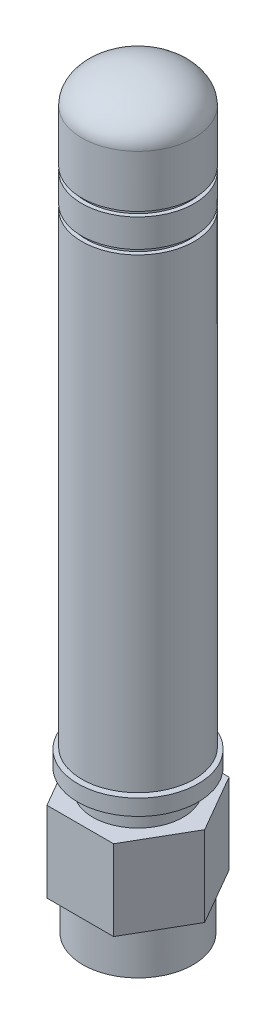
ISO-10303-21;
HEADER;
FILE_DESCRIPTION(('STEP AP214'),'2;1');
FILE_NAME('part.step','',(''),(''),'','','');
FILE_SCHEMA(('AUTOMOTIVE_DESIGN { 1 0 10303 214 1 1 1 1 }'));
ENDSEC;
DATA;
#1=APPLICATION_CONTEXT('core data for automotive mechanical design processes');
#2=APPLICATION_PROTOCOL_DEFINITION('international standard','automotive_design',2000,#1);
#3=PRODUCT_CONTEXT('',#1,'mechanical');
#4=PRODUCT('Part','Part','',(#3));
#5=PRODUCT_RELATED_PRODUCT_CATEGORY('part','',(#4));
#6=PRODUCT_DEFINITION_FORMATION('','',#4);
#7=PRODUCT_DEFINITION_CONTEXT('part definition',#1,'design');
#8=PRODUCT_DEFINITION('design','',#6,#7);
#9=PRODUCT_DEFINITION_SHAPE('','',#8);
#10=(LENGTH_UNIT() NAMED_UNIT(*) SI_UNIT(.MILLI.,.METRE.));
#11=(NAMED_UNIT(*) PLANE_ANGLE_UNIT() SI_UNIT($,.RADIAN.));
#12=(NAMED_UNIT(*) SI_UNIT($,.STERADIAN.) SOLID_ANGLE_UNIT());
#13=UNCERTAINTY_MEASURE_WITH_UNIT(LENGTH_MEASURE(1.E-05),#10,'distance_accuracy_value','');
#14=(GEOMETRIC_REPRESENTATION_CONTEXT(3) GLOBAL_UNCERTAINTY_ASSIGNED_CONTEXT((#13)) GLOBAL_UNIT_ASSIGNED_CONTEXT((#10,
#11,#12)) REPRESENTATION_CONTEXT('',''));
#15=CARTESIAN_POINT('',(0.,0.,0.));
#16=DIRECTION('',(0.,0.,1.));
#17=DIRECTION('',(1.,0.,0.));
#18=AXIS2_PLACEMENT_3D('',#15,#16,#17);
#19=CARTESIAN_POINT('',(2.2225,2.667,0.));
#20=DIRECTION('',(0.,-1.,0.));
#21=DIRECTION('',(0.,0.,-1.));
#22=AXIS2_PLACEMENT_3D('',#19,#20,#21);
#23=PLANE('',#22);
#24=CARTESIAN_POINT('',(0.,2.667,0.));
#25=DIRECTION('',(0.,-1.,0.));
#26=DIRECTION('',(0.,0.,-1.));
#27=AXIS2_PLACEMENT_3D('',#24,#25,#26);
#28=CIRCLE('',#27,3.90525);
#29=CARTESIAN_POINT('',(0.,2.667,-3.90525));
#30=VERTEX_POINT('',#29);
#31=EDGE_CURVE('E12',#30,#30,#28,.T.);
#32=ORIENTED_EDGE('',*,*,#31,.T.);
#33=EDGE_LOOP('',(#32));
#34=FACE_BOUND('',#33,.T.);
#35=CARTESIAN_POINT('',(0.,2.667,0.));
#36=DIRECTION('',(0.,-1.,0.));
#37=DIRECTION('',(0.,0.,-1.));
#38=AXIS2_PLACEMENT_3D('',#35,#36,#37);
#39=CIRCLE('',#38,2.2225);
#40=CARTESIAN_POINT('',(0.,2.667,-2.2225));
#41=VERTEX_POINT('',#40);
#42=EDGE_CURVE('E118',#41,#41,#39,.T.);
#43=ORIENTED_EDGE('',*,*,#42,.F.);
#44=EDGE_LOOP('',(#43));
#45=FACE_BOUND('',#44,.T.);
#46=ADVANCED_FACE('F46',(#34,#45),#23,.T.);
#47=CARTESIAN_POINT('',(0.,0.,0.));
#48=DIRECTION('',(0.,-1.,0.));
#49=DIRECTION('',(0.,0.,-1.));
#50=AXIS2_PLACEMENT_3D('',#47,#48,#49);
#51=CYLINDRICAL_SURFACE('',#50,3.90525);
#52=CARTESIAN_POINT('',(0.,35.0393,0.));
#53=DIRECTION('',(0.,-1.,0.));
#54=DIRECTION('',(0.,0.,-1.));
#55=AXIS2_PLACEMENT_3D('',#52,#53,#54);
#56=CIRCLE('',#55,3.90525);
#57=CARTESIAN_POINT('',(0.,35.0393,-3.90525));
#58=VERTEX_POINT('',#57);
#59=EDGE_CURVE('E52',#58,#58,#56,.T.);
#60=ORIENTED_EDGE('',*,*,#59,.T.);
#61=EDGE_LOOP('',(#60));
#62=FACE_BOUND('',#61,.T.);
#63=ORIENTED_EDGE('',*,*,#31,.F.);
#64=EDGE_LOOP('',(#63));
#65=FACE_BOUND('',#64,.T.);
#66=ADVANCED_FACE('F95',(#62,#65),#51,.T.);
#67=CARTESIAN_POINT('',(3.90525,35.0393,0.));
#68=DIRECTION('',(0.,1.,0.));
#69=DIRECTION('',(0.,0.,1.));
#70=AXIS2_PLACEMENT_3D('',#67,#68,#69);
#71=PLANE('',#70);
#72=CARTESIAN_POINT('',(0.,35.0393,0.));
#73=DIRECTION('',(0.,-1.,0.));
#74=DIRECTION('',(0.,0.,-1.));
#75=AXIS2_PLACEMENT_3D('',#72,#73,#74);
#76=CIRCLE('',#75,3.6195);
#77=CARTESIAN_POINT('',(0.,35.0393,-3.6195));
#78=VERTEX_POINT('',#77);
#79=EDGE_CURVE('E90',#78,#78,#76,.T.);
#80=ORIENTED_EDGE('',*,*,#79,.T.);
#81=EDGE_LOOP('',(#80));
#82=FACE_BOUND('',#81,.T.);
#83=ORIENTED_EDGE('',*,*,#59,.F.);
#84=EDGE_LOOP('',(#83));
#85=FACE_BOUND('',#84,.T.);
#86=ADVANCED_FACE('F98',(#82,#85),#71,.T.);
#87=CARTESIAN_POINT('',(0.,0.,0.));
#88=DIRECTION('',(0.,-1.,0.));
#89=DIRECTION('',(0.,0.,-1.));
#90=AXIS2_PLACEMENT_3D('',#87,#88,#89);
#91=CYLINDRICAL_SURFACE('',#90,3.6195);
#92=CARTESIAN_POINT('',(0.,35.3695,0.));
#93=DIRECTION('',(0.,-1.,0.));
#94=DIRECTION('',(0.,0.,-1.));
#95=AXIS2_PLACEMENT_3D('',#92,#93,#94);
#96=CIRCLE('',#95,3.6195);
#97=CARTESIAN_POINT('',(0.,35.3695,-3.6195));
#98=VERTEX_POINT('',#97);
#99=EDGE_CURVE('E87',#98,#98,#96,.T.);
#100=ORIENTED_EDGE('',*,*,#99,.T.);
#101=EDGE_LOOP('',(#100));
#102=FACE_BOUND('',#101,.T.);
#103=ORIENTED_EDGE('',*,*,#79,.F.);
#104=EDGE_LOOP('',(#103));
#105=FACE_BOUND('',#104,.T.);
#106=ADVANCED_FACE('F100',(#102,#105),#91,.T.);
#107=CARTESIAN_POINT('',(3.6195,35.3695,0.));
#108=DIRECTION('',(0.,-1.,0.));
#109=DIRECTION('',(0.,0.,-1.));
#110=AXIS2_PLACEMENT_3D('',#107,#108,#109);
#111=PLANE('',#110);
#112=CARTESIAN_POINT('',(0.,35.3695,0.));
#113=DIRECTION('',(0.,-1.,0.));
#114=DIRECTION('',(0.,0.,-1.));
#115=AXIS2_PLACEMENT_3D('',#112,#113,#114);
#116=CIRCLE('',#115,3.90525);
#117=CARTESIAN_POINT('',(0.,35.3695,-3.90525));
#118=VERTEX_POINT('',#117);
#119=EDGE_CURVE('E84',#118,#118,#116,.T.);
#120=ORIENTED_EDGE('',*,*,#119,.T.);
#121=EDGE_LOOP('',(#120));
#122=FACE_BOUND('',#121,.T.);
#123=ORIENTED_EDGE('',*,*,#99,.F.);
#124=EDGE_LOOP('',(#123));
#125=FACE_BOUND('',#124,.T.);
#126=ADVANCED_FACE('F107',(#122,#125),#111,.T.);
#127=CARTESIAN_POINT('',(0.,0.,0.));
#128=DIRECTION('',(0.,-1.,0.));
#129=DIRECTION('',(0.,0.,-1.));
#130=AXIS2_PLACEMENT_3D('',#127,#128,#129);
#131=CYLINDRICAL_SURFACE('',#130,3.90525);
#132=CARTESIAN_POINT('',(0.,37.3253,0.));
#133=DIRECTION('',(0.,-1.,0.));
#134=DIRECTION('',(0.,0.,-1.));
#135=AXIS2_PLACEMENT_3D('',#132,#133,#134);
#136=CIRCLE('',#135,3.90525);
#137=CARTESIAN_POINT('',(0.,37.3253,-3.90525));
#138=VERTEX_POINT('',#137);
#139=EDGE_CURVE('E81',#138,#138,#136,.T.);
#140=ORIENTED_EDGE('',*,*,#139,.T.);
#141=EDGE_LOOP('',(#140));
#142=FACE_BOUND('',#141,.T.);
#143=ORIENTED_EDGE('',*,*,#119,.F.);
#144=EDGE_LOOP('',(#143));
#145=FACE_BOUND('',#144,.T.);
#146=ADVANCED_FACE('F160',(#142,#145),#131,.T.);
#147=CARTESIAN_POINT('',(3.90525,37.3253,0.));
#148=DIRECTION('',(0.,1.,0.));
#149=DIRECTION('',(0.,0.,1.));
#150=AXIS2_PLACEMENT_3D('',#147,#148,#149);
#151=PLANE('',#150);
#152=CARTESIAN_POINT('',(0.,37.3253,0.));
#153=DIRECTION('',(0.,-1.,0.));
#154=DIRECTION('',(0.,0.,-1.));
#155=AXIS2_PLACEMENT_3D('',#152,#153,#154);
#156=CIRCLE('',#155,3.6195);
#157=CARTESIAN_POINT('',(0.,37.3253,-3.6195));
#158=VERTEX_POINT('',#157);
#159=EDGE_CURVE('E78',#158,#158,#156,.T.);
#160=ORIENTED_EDGE('',*,*,#159,.T.);
#161=EDGE_LOOP('',(#160));
#162=FACE_BOUND('',#161,.T.);
#163=ORIENTED_EDGE('',*,*,#139,.F.);
#164=EDGE_LOOP('',(#163));
#165=FACE_BOUND('',#164,.T.);
#166=ADVANCED_FACE('F156',(#162,#165),#151,.T.);
#167=CARTESIAN_POINT('',(0.,0.,0.));
#168=DIRECTION('',(0.,-1.,0.));
#169=DIRECTION('',(0.,0.,-1.));
#170=AXIS2_PLACEMENT_3D('',#167,#168,#169);
#171=CYLINDRICAL_SURFACE('',#170,3.6195);
#172=CARTESIAN_POINT('',(0.,37.6555,0.));
#173=DIRECTION('',(0.,-1.,0.));
#174=DIRECTION('',(0.,0.,-1.));
#175=AXIS2_PLACEMENT_3D('',#172,#173,#174);
#176=CIRCLE('',#175,3.6195);
#177=CARTESIAN_POINT('',(0.,37.6555,-3.6195));
#178=VERTEX_POINT('',#177);
#179=EDGE_CURVE('E69',#178,#178,#176,.T.);
#180=ORIENTED_EDGE('',*,*,#179,.T.);
#181=EDGE_LOOP('',(#180));
#182=FACE_BOUND('',#181,.T.);
#183=ORIENTED_EDGE('',*,*,#159,.F.);
#184=EDGE_LOOP('',(#183));
#185=FACE_BOUND('',#184,.T.);
#186=ADVANCED_FACE('F152',(#182,#185),#171,.T.);
#187=CARTESIAN_POINT('',(3.6195,37.6555,0.));
#188=DIRECTION('',(0.,-1.,0.));
#189=DIRECTION('',(0.,0.,-1.));
#190=AXIS2_PLACEMENT_3D('',#187,#188,#189);
#191=PLANE('',#190);
#192=CARTESIAN_POINT('',(0.,37.6555,0.));
#193=DIRECTION('',(0.,-1.,0.));
#194=DIRECTION('',(0.,0.,-1.));
#195=AXIS2_PLACEMENT_3D('',#192,#193,#194);
#196=CIRCLE('',#195,3.90525);
#197=CARTESIAN_POINT('',(0.,37.6555,-3.90525));
#198=VERTEX_POINT('',#197);
#199=EDGE_CURVE('E65',#198,#198,#196,.T.);
#200=ORIENTED_EDGE('',*,*,#199,.T.);
#201=EDGE_LOOP('',(#200));
#202=FACE_BOUND('',#201,.T.);
#203=ORIENTED_EDGE('',*,*,#179,.F.);
#204=EDGE_LOOP('',(#203));
#205=FACE_BOUND('',#204,.T.);
#206=ADVANCED_FACE('F149',(#202,#205),#191,.T.);
#207=CARTESIAN_POINT('',(0.,0.,0.));
#208=DIRECTION('',(0.,-1.,0.));
#209=DIRECTION('',(0.,0.,-1.));
#210=AXIS2_PLACEMENT_3D('',#207,#208,#209);
#211=CYLINDRICAL_SURFACE('',#210,3.90525);
#212=CARTESIAN_POINT('',(0.,41.275,0.));
#213=DIRECTION('',(0.,-1.,0.));
#214=DIRECTION('',(0.,0.,-1.));
#215=AXIS2_PLACEMENT_3D('',#212,#213,#214);
#216=CIRCLE('',#215,3.90525);
#217=CARTESIAN_POINT('',(0.,41.275,-3.90525));
#218=VERTEX_POINT('',#217);
#219=EDGE_CURVE('E63',#218,#218,#216,.T.);
#220=ORIENTED_EDGE('',*,*,#219,.T.);
#221=EDGE_LOOP('',(#220));
#222=FACE_BOUND('',#221,.T.);
#223=ORIENTED_EDGE('',*,*,#199,.F.);
#224=EDGE_LOOP('',(#223));
#225=FACE_BOUND('',#224,.T.);
#226=ADVANCED_FACE('F59',(#222,#225),#211,.T.);
#227=CARTESIAN_POINT('',(0.,41.275,0.));
#228=DIRECTION('',(0.,0.,1.));
#229=DIRECTION('',(1.,0.,0.));
#230=AXIS2_PLACEMENT_3D('',#227,#228,#229);
#231=ELLIPSE('',#230,3.90525,2.286);
#232=TRIMMED_CURVE('',#231,(PARAMETER_VALUE(-1.5707963267949)),
(PARAMETER_VALUE(1.5707963267949)),.T.,.PARAMETER.);
#233=CARTESIAN_POINT('',(0.,0.,0.));
#234=DIRECTION('',(0.,-1.,0.));
#235=AXIS1_PLACEMENT('',#233,#234);
#236=SURFACE_OF_REVOLUTION('',#232,#235);
#237=CARTESIAN_POINT('',(0.,43.561,0.));
#238=VERTEX_POINT('',#237);
#239=VERTEX_LOOP('',#238);
#240=FACE_BOUND('',#239,.T.);
#241=ORIENTED_EDGE('',*,*,#219,.F.);
#242=EDGE_LOOP('',(#241));
#243=FACE_BOUND('',#242,.T.);
#244=ADVANCED_FACE('F55',(#240,#243),#236,.F.);
#245=CARTESIAN_POINT('',(0.368300000000001,41.275,0.));
#246=DIRECTION('',(0.,-1.,0.));
#247=DIRECTION('',(0.,0.,-1.));
#248=AXIS2_PLACEMENT_3D('',#245,#246,#247);
#249=PLANE('',#248);
#250=CARTESIAN_POINT('',(0.,41.275,0.));
#251=DIRECTION('',(0.,-1.,0.));
#252=DIRECTION('',(0.,0.,-1.));
#253=AXIS2_PLACEMENT_3D('',#250,#251,#252);
#254=CIRCLE('',#253,0.368300000000001);
#255=CARTESIAN_POINT('',(0.,41.275,-0.368300000000001));
#256=VERTEX_POINT('',#255);
#257=EDGE_CURVE('E66',#256,#256,#254,.T.);
#258=ORIENTED_EDGE('',*,*,#257,.T.);
#259=EDGE_LOOP('',(#258));
#260=FACE_BOUND('',#259,.T.);
#261=ADVANCED_FACE('F58',(#260),#249,.T.);
#262=CARTESIAN_POINT('',(0.,0.,0.));
#263=DIRECTION('',(0.,-1.,0.));
#264=DIRECTION('',(0.,0.,-1.));
#265=AXIS2_PLACEMENT_3D('',#262,#263,#264);
#266=CYLINDRICAL_SURFACE('',#265,0.368300000000001);
#267=CARTESIAN_POINT('',(0.,3.937,0.));
#268=DIRECTION('',(0.,-1.,0.));
#269=DIRECTION('',(0.,0.,-1.));
#270=AXIS2_PLACEMENT_3D('',#267,#268,#269);
#271=CIRCLE('',#270,0.3683);
#272=CARTESIAN_POINT('',(0.,3.937,-0.3683));
#273=VERTEX_POINT('',#272);
#274=EDGE_CURVE('E72',#273,#273,#271,.T.);
#275=ORIENTED_EDGE('',*,*,#274,.T.);
#276=EDGE_LOOP('',(#275));
#277=FACE_BOUND('',#276,.T.);
#278=ORIENTED_EDGE('',*,*,#257,.F.);
#279=EDGE_LOOP('',(#278));
#280=FACE_BOUND('',#279,.T.);
#281=ADVANCED_FACE('F129',(#277,#280),#266,.F.);
#282=CARTESIAN_POINT('',(2.2225,3.937,0.));
#283=DIRECTION('',(0.,-1.,0.));
#284=DIRECTION('',(0.,0.,-1.));
#285=AXIS2_PLACEMENT_3D('',#282,#283,#284);
#286=PLANE('',#285);
#287=CARTESIAN_POINT('',(0.,3.937,0.));
#288=DIRECTION('',(0.,-1.,0.));
#289=DIRECTION('',(0.,0.,-1.));
#290=AXIS2_PLACEMENT_3D('',#287,#288,#289);
#291=CIRCLE('',#290,2.2225);
#292=CARTESIAN_POINT('',(0.,3.937,-2.2225));
#293=VERTEX_POINT('',#292);
#294=EDGE_CURVE('E120',#293,#293,#291,.T.);
#295=ORIENTED_EDGE('',*,*,#294,.T.);
#296=EDGE_LOOP('',(#295));
#297=FACE_BOUND('',#296,.T.);
#298=ORIENTED_EDGE('',*,*,#274,.F.);
#299=EDGE_LOOP('',(#298));
#300=FACE_BOUND('',#299,.T.);
#301=ADVANCED_FACE('F132',(#297,#300),#286,.T.);
#302=CARTESIAN_POINT('',(0.,0.,0.));
#303=DIRECTION('',(0.,-1.,0.));
#304=DIRECTION('',(0.,0.,-1.));
#305=AXIS2_PLACEMENT_3D('',#302,#303,#304);
#306=CYLINDRICAL_SURFACE('',#305,2.2225);
#307=ORIENTED_EDGE('',*,*,#42,.T.);
#308=EDGE_LOOP('',(#307));
#309=FACE_BOUND('',#308,.T.);
#310=ORIENTED_EDGE('',*,*,#294,.F.);
#311=EDGE_LOOP('',(#310));
#312=FACE_BOUND('',#311,.T.);
#313=ADVANCED_FACE('F134',(#309,#312),#306,.F.);
#314=CLOSED_SHELL('',(#46,#66,#86,#106,#126,#146,#166,#186,#206,#226,#244,#261,#281,#301,#313));
#315=MANIFOLD_SOLID_BREP('B2',#314);
#316=CARTESIAN_POINT('',(0.,0.,0.));
#317=DIRECTION('',(0.,1.,0.));
#318=DIRECTION('',(-1.,0.,0.));
#319=AXIS2_PLACEMENT_3D('',#316,#317,#318);
#320=CYLINDRICAL_SURFACE('',#319,3.8354);
#321=CARTESIAN_POINT('',(0.,-8.5344,0.));
#322=DIRECTION('',(0.,1.,0.));
#323=DIRECTION('',(-1.,0.,0.));
#324=AXIS2_PLACEMENT_3D('',#321,#322,#323);
#325=CIRCLE('',#324,3.8354);
#326=CARTESIAN_POINT('',(-3.8354,-8.5344,0.));
#327=VERTEX_POINT('',#326);
#328=EDGE_CURVE('E398',#327,#327,#325,.T.);
#329=ORIENTED_EDGE('',*,*,#328,.T.);
#330=EDGE_LOOP('',(#329));
#331=FACE_BOUND('',#330,.T.);
#332=CARTESIAN_POINT('',(0.,-5.588,0.));
#333=DIRECTION('',(0.,1.,0.));
#334=DIRECTION('',(0.,0.,1.));
#335=AXIS2_PLACEMENT_3D('',#332,#333,#334);
#336=CIRCLE('',#335,3.8354);
#337=CARTESIAN_POINT('',(0.,-5.588,3.8354));
#338=VERTEX_POINT('',#337);
#339=EDGE_CURVE('E44',#338,#338,#336,.T.);
#340=ORIENTED_EDGE('',*,*,#339,.F.);
#341=EDGE_LOOP('',(#340));
#342=FACE_BOUND('',#341,.T.);
#343=ADVANCED_FACE('F270',(#331,#342),#320,.T.);
#344=CARTESIAN_POINT('',(0.368300000000001,3.81,0.));
#345=DIRECTION('',(0.,-1.,0.));
#346=DIRECTION('',(1.,0.,0.));
#347=AXIS2_PLACEMENT_3D('',#344,#345,#346);
#348=PLANE('',#347);
#349=CARTESIAN_POINT('',(0.,3.81,0.));
#350=DIRECTION('',(0.,1.,0.));
#351=DIRECTION('',(-1.,0.,0.));
#352=AXIS2_PLACEMENT_3D('',#349,#350,#351);
#353=CIRCLE('',#352,0.368300000000001);
#354=CARTESIAN_POINT('',(-0.368300000000002,3.81,0.));
#355=VERTEX_POINT('',#354);
#356=EDGE_CURVE('E375',#355,#355,#353,.T.);
#357=ORIENTED_EDGE('',*,*,#356,.F.);
#358=EDGE_LOOP('',(#357));
#359=FACE_BOUND('',#358,.T.);
#360=CARTESIAN_POINT('',(0.,3.81,0.));
#361=DIRECTION('',(0.,1.,0.));
#362=DIRECTION('',(-1.,0.,0.));
#363=AXIS2_PLACEMENT_3D('',#360,#361,#362);
#364=CIRCLE('',#363,2.0955);
#365=CARTESIAN_POINT('',(-2.0955,3.81,0.));
#366=VERTEX_POINT('',#365);
#367=EDGE_CURVE('E279',#366,#366,#364,.T.);
#368=ORIENTED_EDGE('',*,*,#367,.T.);
#369=EDGE_LOOP('',(#368));
#370=FACE_BOUND('',#369,.T.);
#371=ADVANCED_FACE('F272',(#359,#370),#348,.F.);
#372=CARTESIAN_POINT('',(0.,0.,0.));
#373=DIRECTION('',(0.,1.,0.));
#374=DIRECTION('',(-1.,0.,0.));
#375=AXIS2_PLACEMENT_3D('',#372,#373,#374);
#376=CYLINDRICAL_SURFACE('',#375,2.0955);
#377=ORIENTED_EDGE('',*,*,#367,.F.);
#378=EDGE_LOOP('',(#377));
#379=FACE_BOUND('',#378,.T.);
#380=CARTESIAN_POINT('',(0.,2.54,0.));
#381=DIRECTION('',(0.,1.,0.));
#382=DIRECTION('',(-1.,0.,0.));
#383=AXIS2_PLACEMENT_3D('',#380,#381,#382);
#384=CIRCLE('',#383,2.0955);
#385=CARTESIAN_POINT('',(-2.0955,2.54,0.));
#386=VERTEX_POINT('',#385);
#387=EDGE_CURVE('E413',#386,#386,#384,.T.);
#388=ORIENTED_EDGE('',*,*,#387,.T.);
#389=EDGE_LOOP('',(#388));
#390=FACE_BOUND('',#389,.T.);
#391=ADVANCED_FACE('F419',(#379,#390),#376,.T.);
#392=CARTESIAN_POINT('',(2.0955,2.54,0.));
#393=DIRECTION('',(0.,-1.,0.));
#394=DIRECTION('',(1.,0.,0.));
#395=AXIS2_PLACEMENT_3D('',#392,#393,#394);
#396=PLANE('',#395);
#397=ORIENTED_EDGE('',*,*,#387,.F.);
#398=EDGE_LOOP('',(#397));
#399=FACE_BOUND('',#398,.T.);
#400=CARTESIAN_POINT('',(0.,2.54,0.));
#401=DIRECTION('',(0.,1.,0.));
#402=DIRECTION('',(-1.,0.,0.));
#403=AXIS2_PLACEMENT_3D('',#400,#401,#402);
#404=CIRCLE('',#403,4.18465);
#405=CARTESIAN_POINT('',(-4.18465,2.54,0.));
#406=VERTEX_POINT('',#405);
#407=EDGE_CURVE('E410',#406,#406,#404,.T.);
#408=ORIENTED_EDGE('',*,*,#407,.T.);
#409=EDGE_LOOP('',(#408));
#410=FACE_BOUND('',#409,.T.);
#411=ADVANCED_FACE('F422',(#399,#410),#396,.F.);
#412=CARTESIAN_POINT('',(0.,0.,0.));
#413=DIRECTION('',(0.,1.,0.));
#414=DIRECTION('',(-1.,0.,0.));
#415=AXIS2_PLACEMENT_3D('',#412,#413,#414);
#416=CYLINDRICAL_SURFACE('',#415,4.18465);
#417=ORIENTED_EDGE('',*,*,#407,.F.);
#418=EDGE_LOOP('',(#417));
#419=FACE_BOUND('',#418,.T.);
#420=CARTESIAN_POINT('',(0.,1.4351,0.));
#421=DIRECTION('',(0.,1.,0.));
#422=DIRECTION('',(-1.,0.,0.));
#423=AXIS2_PLACEMENT_3D('',#420,#421,#422);
#424=CIRCLE('',#423,4.18465);
#425=CARTESIAN_POINT('',(-4.18465,1.4351,0.));
#426=VERTEX_POINT('',#425);
#427=EDGE_CURVE('E407',#426,#426,#424,.T.);
#428=ORIENTED_EDGE('',*,*,#427,.T.);
#429=EDGE_LOOP('',(#428));
#430=FACE_BOUND('',#429,.T.);
#431=ADVANCED_FACE('F427',(#419,#430),#416,.T.);
#432=CARTESIAN_POINT('',(4.18465,1.4351,0.));
#433=DIRECTION('',(0.,1.,0.));
#434=DIRECTION('',(-1.,0.,0.));
#435=AXIS2_PLACEMENT_3D('',#432,#433,#434);
#436=PLANE('',#435);
#437=ORIENTED_EDGE('',*,*,#427,.F.);
#438=EDGE_LOOP('',(#437));
#439=FACE_BOUND('',#438,.T.);
#440=CARTESIAN_POINT('',(0.,1.4351,0.));
#441=DIRECTION('',(0.,1.,0.));
#442=DIRECTION('',(-1.,0.,0.));
#443=AXIS2_PLACEMENT_3D('',#440,#441,#442);
#444=CIRCLE('',#443,3.14325);
#445=CARTESIAN_POINT('',(-3.14325,1.4351,0.));
#446=VERTEX_POINT('',#445);
#447=EDGE_CURVE('E404',#446,#446,#444,.T.);
#448=ORIENTED_EDGE('',*,*,#447,.T.);
#449=EDGE_LOOP('',(#448));
#450=FACE_BOUND('',#449,.T.);
#451=ADVANCED_FACE('F433',(#439,#450),#436,.F.);
#452=CARTESIAN_POINT('',(0.,0.,0.));
#453=DIRECTION('',(0.,1.,0.));
#454=DIRECTION('',(-1.,0.,0.));
#455=AXIS2_PLACEMENT_3D('',#452,#453,#454);
#456=CYLINDRICAL_SURFACE('',#455,3.14325);
#457=ORIENTED_EDGE('',*,*,#447,.F.);
#458=EDGE_LOOP('',(#457));
#459=FACE_BOUND('',#458,.T.);
#460=CARTESIAN_POINT('',(0.,0.,0.));
#461=DIRECTION('',(0.,1.,0.));
#462=DIRECTION('',(-1.,0.,0.));
#463=AXIS2_PLACEMENT_3D('',#460,#461,#462);
#464=CIRCLE('',#463,3.14325);
#465=CARTESIAN_POINT('',(-3.14325,0.,0.));
#466=VERTEX_POINT('',#465);
#467=EDGE_CURVE('E401',#466,#466,#464,.T.);
#468=ORIENTED_EDGE('',*,*,#467,.T.);
#469=EDGE_LOOP('',(#468));
#470=FACE_BOUND('',#469,.T.);
#471=ADVANCED_FACE('F439',(#459,#470),#456,.T.);
#472=CARTESIAN_POINT('',(3.14325,0.,0.));
#473=DIRECTION('',(0.,-1.,0.));
#474=DIRECTION('',(1.,0.,0.));
#475=AXIS2_PLACEMENT_3D('',#472,#473,#474);
#476=PLANE('',#475);
#477=ORIENTED_EDGE('',*,*,#467,.F.);
#478=EDGE_LOOP('',(#477));
#479=FACE_BOUND('',#478,.T.);
#480=DIRECTION('',(0.499999999999995,0.,-0.866025403784442));
#481=VECTOR('',#480,1.);
#482=CARTESIAN_POINT('',(2.31702210031185,0.,4.01319999999997));
#483=LINE('',#482,#481);
#484=CARTESIAN_POINT('',(2.31702210031185,0.,4.01319999999997));
#485=VERTEX_POINT('',#484);
#486=CARTESIAN_POINT('',(4.63404420062361,0.,0.));
#487=VERTEX_POINT('',#486);
#488=EDGE_CURVE('E358',#485,#487,#483,.T.);
#489=ORIENTED_EDGE('',*,*,#488,.T.);
#490=DIRECTION('',(-0.500000000000001,0.,-0.866025403784438));
#491=VECTOR('',#490,1.);
#492=CARTESIAN_POINT('',(4.63404420062361,0.,0.));
#493=LINE('',#492,#491);
#494=CARTESIAN_POINT('',(2.3170221003118,0.,-4.01320000000001));
#495=VERTEX_POINT('',#494);
#496=EDGE_CURVE('E361',#487,#495,#493,.T.);
#497=ORIENTED_EDGE('',*,*,#496,.T.);
#498=DIRECTION('',(-1.,0.,0.));
#499=VECTOR('',#498,1.);
#500=CARTESIAN_POINT('',(2.3170221003118,0.,-4.01320000000001));
#501=LINE('',#500,#499);
#502=CARTESIAN_POINT('',(-2.31702210031183,0.,-4.01319999999999));
#503=VERTEX_POINT('',#502);
#504=EDGE_CURVE('E364',#495,#503,#501,.T.);
#505=ORIENTED_EDGE('',*,*,#504,.T.);
#506=DIRECTION('',(-0.499999999999995,0.,0.866025403784442));
#507=VECTOR('',#506,1.);
#508=CARTESIAN_POINT('',(-2.31702210031183,0.,-4.01319999999999));
#509=LINE('',#508,#507);
#510=CARTESIAN_POINT('',(-4.63404420062361,0.,0.));
#511=VERTEX_POINT('',#510);
#512=EDGE_CURVE('E367',#503,#511,#509,.T.);
#513=ORIENTED_EDGE('',*,*,#512,.T.);
#514=DIRECTION('',(0.500000000000007,0.,0.866025403784435));
#515=VECTOR('',#514,1.);
#516=CARTESIAN_POINT('',(-4.63404420062361,0.,0.));
#517=LINE('',#516,#515);
#518=CARTESIAN_POINT('',(-2.31702210031177,0.,4.01320000000002));
#519=VERTEX_POINT('',#518);
#520=EDGE_CURVE('E335',#511,#519,#517,.T.);
#521=ORIENTED_EDGE('',*,*,#520,.T.);
#522=DIRECTION('',(1.,0.,0.));
#523=VECTOR('',#522,1.);
#524=CARTESIAN_POINT('',(-2.31702210031177,0.,4.01320000000002));
#525=LINE('',#524,#523);
#526=EDGE_CURVE('E370',#519,#485,#525,.T.);
#527=ORIENTED_EDGE('',*,*,#526,.T.);
#528=EDGE_LOOP('',(#489,#497,#505,#513,#521,#527));
#529=FACE_BOUND('',#528,.T.);
#530=ADVANCED_FACE('F445',(#479,#529),#476,.F.);
#531=CARTESIAN_POINT('',(3.8354,-8.5344,0.));
#532=DIRECTION('',(0.,1.,0.));
#533=DIRECTION('',(-1.,0.,0.));
#534=AXIS2_PLACEMENT_3D('',#531,#532,#533);
#535=PLANE('',#534);
#536=ORIENTED_EDGE('',*,*,#328,.F.);
#537=EDGE_LOOP('',(#536));
#538=FACE_BOUND('',#537,.T.);
#539=CARTESIAN_POINT('',(0.,-8.5344,0.));
#540=DIRECTION('',(0.,1.,0.));
#541=DIRECTION('',(-1.,0.,0.));
#542=AXIS2_PLACEMENT_3D('',#539,#540,#541);
#543=CIRCLE('',#542,3.3528);
#544=CARTESIAN_POINT('',(-3.3528,-8.5344,0.));
#545=VERTEX_POINT('',#544);
#546=EDGE_CURVE('E395',#545,#545,#543,.T.);
#547=ORIENTED_EDGE('',*,*,#546,.T.);
#548=EDGE_LOOP('',(#547));
#549=FACE_BOUND('',#548,.T.);
#550=ADVANCED_FACE('F451',(#538,#549),#535,.F.);
#551=CARTESIAN_POINT('',(0.,0.,0.));
#552=DIRECTION('',(0.,1.,0.));
#553=DIRECTION('',(-1.,0.,0.));
#554=AXIS2_PLACEMENT_3D('',#551,#552,#553);
#555=CYLINDRICAL_SURFACE('',#554,3.3528);
#556=ORIENTED_EDGE('',*,*,#546,.F.);
#557=EDGE_LOOP('',(#556));
#558=FACE_BOUND('',#557,.T.);
#559=CARTESIAN_POINT('',(0.,-3.9624,0.));
#560=DIRECTION('',(0.,1.,0.));
#561=DIRECTION('',(-1.,0.,0.));
#562=AXIS2_PLACEMENT_3D('',#559,#560,#561);
#563=CIRCLE('',#562,3.3528);
#564=CARTESIAN_POINT('',(-3.3528,-3.9624,0.));
#565=VERTEX_POINT('',#564);
#566=EDGE_CURVE('E392',#565,#565,#563,.T.);
#567=ORIENTED_EDGE('',*,*,#566,.T.);
#568=EDGE_LOOP('',(#567));
#569=FACE_BOUND('',#568,.T.);
#570=ADVANCED_FACE('F480',(#558,#569),#555,.F.);
#571=CARTESIAN_POINT('',(2.5273,-3.9624,0.));
#572=DIRECTION('',(0.,1.,0.));
#573=DIRECTION('',(-1.,0.,0.));
#574=AXIS2_PLACEMENT_3D('',#571,#572,#573);
#575=PLANE('',#574);
#576=ORIENTED_EDGE('',*,*,#566,.F.);
#577=EDGE_LOOP('',(#576));
#578=FACE_BOUND('',#577,.T.);
#579=CARTESIAN_POINT('',(0.,-3.9624,0.));
#580=DIRECTION('',(0.,1.,0.));
#581=DIRECTION('',(-1.,0.,0.));
#582=AXIS2_PLACEMENT_3D('',#579,#580,#581);
#583=CIRCLE('',#582,2.286);
#584=CARTESIAN_POINT('',(-2.286,-3.9624,0.));
#585=VERTEX_POINT('',#584);
#586=EDGE_CURVE('E389',#585,#585,#583,.T.);
#587=ORIENTED_EDGE('',*,*,#586,.T.);
#588=EDGE_LOOP('',(#587));
#589=FACE_BOUND('',#588,.T.);
#590=ADVANCED_FACE('F484',(#578,#589),#575,.F.);
#591=CARTESIAN_POINT('',(0.,0.,0.));
#592=DIRECTION('',(0.,1.,0.));
#593=DIRECTION('',(-1.,0.,0.));
#594=AXIS2_PLACEMENT_3D('',#591,#592,#593);
#595=CYLINDRICAL_SURFACE('',#594,2.286);
#596=ORIENTED_EDGE('',*,*,#586,.F.);
#597=EDGE_LOOP('',(#596));
#598=FACE_BOUND('',#597,.T.);
#599=CARTESIAN_POINT('',(0.,-5.7531,0.));
#600=DIRECTION('',(0.,1.,0.));
#601=DIRECTION('',(-1.,0.,0.));
#602=AXIS2_PLACEMENT_3D('',#599,#600,#601);
#603=CIRCLE('',#602,2.286);
#604=CARTESIAN_POINT('',(-2.286,-5.7531,0.));
#605=VERTEX_POINT('',#604);
#606=EDGE_CURVE('E386',#605,#605,#603,.T.);
#607=ORIENTED_EDGE('',*,*,#606,.T.);
#608=EDGE_LOOP('',(#607));
#609=FACE_BOUND('',#608,.T.);
#610=ADVANCED_FACE('F488',(#598,#609),#595,.T.);
#611=CARTESIAN_POINT('',(2.286,-5.7531,0.));
#612=DIRECTION('',(0.,1.,0.));
#613=DIRECTION('',(-1.,0.,0.));
#614=AXIS2_PLACEMENT_3D('',#611,#612,#613);
#615=PLANE('',#614);
#616=ORIENTED_EDGE('',*,*,#606,.F.);
#617=EDGE_LOOP('',(#616));
#618=FACE_BOUND('',#617,.T.);
#619=CARTESIAN_POINT('',(0.,-5.7531,0.));
#620=DIRECTION('',(0.,1.,0.));
#621=DIRECTION('',(-1.,0.,0.));
#622=AXIS2_PLACEMENT_3D('',#619,#620,#621);
#623=CIRCLE('',#622,0.3683);
#624=CARTESIAN_POINT('',(-0.368299999999999,-5.7531,0.));
#625=VERTEX_POINT('',#624);
#626=EDGE_CURVE('E383',#625,#625,#623,.T.);
#627=ORIENTED_EDGE('',*,*,#626,.T.);
#628=EDGE_LOOP('',(#627));
#629=FACE_BOUND('',#628,.T.);
#630=ADVANCED_FACE('F492',(#618,#629),#615,.F.);
#631=CARTESIAN_POINT('',(0.,0.,0.));
#632=DIRECTION('',(0.,1.,0.));
#633=DIRECTION('',(-1.,0.,0.));
#634=AXIS2_PLACEMENT_3D('',#631,#632,#633);
#635=CYLINDRICAL_SURFACE('',#634,0.368300000000001);
#636=ORIENTED_EDGE('',*,*,#626,.F.);
#637=EDGE_LOOP('',(#636));
#638=FACE_BOUND('',#637,.T.);
#639=ORIENTED_EDGE('',*,*,#356,.T.);
#640=EDGE_LOOP('',(#639));
#641=FACE_BOUND('',#640,.T.);
#642=ADVANCED_FACE('F466',(#638,#641),#635,.F.);
#643=CARTESIAN_POINT('',(2.31702210031185,-5.588,4.01319999999997));
#644=DIRECTION('',(0.866025403784442,0.,0.499999999999995));
#645=DIRECTION('',(0.499999999999995,0.,-0.866025403784442));
#646=AXIS2_PLACEMENT_3D('',#643,#644,#645);
#647=PLANE('',#646);
#648=ORIENTED_EDGE('',*,*,#488,.F.);
#649=DIRECTION('',(0.,1.,0.));
#650=VECTOR('',#649,1.);
#651=CARTESIAN_POINT('',(2.31702210031185,-5.588,4.01319999999997));
#652=LINE('',#651,#650);
#653=CARTESIAN_POINT('',(2.31702210031185,-5.588,4.01319999999997));
#654=VERTEX_POINT('',#653);
#655=EDGE_CURVE('E287',#654,#485,#652,.T.);
#656=ORIENTED_EDGE('',*,*,#655,.F.);
#657=DIRECTION('',(0.499999999999995,0.,-0.866025403784442));
#658=VECTOR('',#657,1.);
#659=CARTESIAN_POINT('',(2.31702210031185,-5.588,4.01319999999997));
#660=LINE('',#659,#658);
#661=CARTESIAN_POINT('',(4.63404420062361,-5.588,0.));
#662=VERTEX_POINT('',#661);
#663=EDGE_CURVE('E373',#654,#662,#660,.T.);
#664=ORIENTED_EDGE('',*,*,#663,.T.);
#665=DIRECTION('',(0.,1.,0.));
#666=VECTOR('',#665,1.);
#667=CARTESIAN_POINT('',(4.63404420062361,-5.588,0.));
#668=LINE('',#667,#666);
#669=EDGE_CURVE('E322',#662,#487,#668,.T.);
#670=ORIENTED_EDGE('',*,*,#669,.T.);
#671=EDGE_LOOP('',(#648,#656,#664,#670));
#672=FACE_BOUND('',#671,.T.);
#673=ADVANCED_FACE('F453',(#672),#647,.T.);
#674=CARTESIAN_POINT('',(-2.31702210031177,-5.588,4.01320000000002));
#675=DIRECTION('',(0.,0.,1.));
#676=DIRECTION('',(1.,0.,0.));
#677=AXIS2_PLACEMENT_3D('',#674,#675,#676);
#678=PLANE('',#677);
#679=ORIENTED_EDGE('',*,*,#526,.F.);
#680=DIRECTION('',(0.,1.,0.));
#681=VECTOR('',#680,1.);
#682=CARTESIAN_POINT('',(-2.31702210031177,-5.588,4.01320000000002));
#683=LINE('',#682,#681);
#684=CARTESIAN_POINT('',(-2.31702210031177,-5.588,4.01320000000002));
#685=VERTEX_POINT('',#684);
#686=EDGE_CURVE('E310',#685,#519,#683,.T.);
#687=ORIENTED_EDGE('',*,*,#686,.F.);
#688=DIRECTION('',(1.,0.,0.));
#689=VECTOR('',#688,1.);
#690=CARTESIAN_POINT('',(-2.31702210031177,-5.588,4.01320000000002));
#691=LINE('',#690,#689);
#692=EDGE_CURVE('E348',#685,#654,#691,.T.);
#693=ORIENTED_EDGE('',*,*,#692,.T.);
#694=ORIENTED_EDGE('',*,*,#655,.T.);
#695=EDGE_LOOP('',(#679,#687,#693,#694));
#696=FACE_BOUND('',#695,.T.);
#697=ADVANCED_FACE('F458',(#696),#678,.T.);
#698=CARTESIAN_POINT('',(-4.63404420062361,-5.588,0.));
#699=DIRECTION('',(-0.866025403784435,0.,0.500000000000007));
#700=DIRECTION('',(0.500000000000007,0.,0.866025403784435));
#701=AXIS2_PLACEMENT_3D('',#698,#699,#700);
#702=PLANE('',#701);
#703=ORIENTED_EDGE('',*,*,#520,.F.);
#704=DIRECTION('',(0.,1.,0.));
#705=VECTOR('',#704,1.);
#706=CARTESIAN_POINT('',(-4.63404420062361,-5.588,0.));
#707=LINE('',#706,#705);
#708=CARTESIAN_POINT('',(-4.63404420062361,-5.588,0.));
#709=VERTEX_POINT('',#708);
#710=EDGE_CURVE('E330',#709,#511,#707,.T.);
#711=ORIENTED_EDGE('',*,*,#710,.F.);
#712=DIRECTION('',(0.500000000000007,0.,0.866025403784435));
#713=VECTOR('',#712,1.);
#714=CARTESIAN_POINT('',(-4.63404420062361,-5.588,0.));
#715=LINE('',#714,#713);
#716=EDGE_CURVE('E333',#709,#685,#715,.T.);
#717=ORIENTED_EDGE('',*,*,#716,.T.);
#718=ORIENTED_EDGE('',*,*,#686,.T.);
#719=EDGE_LOOP('',(#703,#711,#717,#718));
#720=FACE_BOUND('',#719,.T.);
#721=ADVANCED_FACE('F332',(#720),#702,.T.);
#722=CARTESIAN_POINT('',(-2.31702210031183,-5.588,-4.01319999999999));
#723=DIRECTION('',(-0.866025403784442,0.,-0.499999999999995));
#724=DIRECTION('',(-0.499999999999995,0.,0.866025403784442));
#725=AXIS2_PLACEMENT_3D('',#722,#723,#724);
#726=PLANE('',#725);
#727=ORIENTED_EDGE('',*,*,#512,.F.);
#728=DIRECTION('',(0.,1.,0.));
#729=VECTOR('',#728,1.);
#730=CARTESIAN_POINT('',(-2.31702210031183,-5.588,-4.01319999999999));
#731=LINE('',#730,#729);
#732=CARTESIAN_POINT('',(-2.31702210031183,-5.588,-4.01319999999999));
#733=VERTEX_POINT('',#732);
#734=EDGE_CURVE('E340',#733,#503,#731,.T.);
#735=ORIENTED_EDGE('',*,*,#734,.F.);
#736=DIRECTION('',(-0.499999999999995,0.,0.866025403784442));
#737=VECTOR('',#736,1.);
#738=CARTESIAN_POINT('',(-2.31702210031183,-5.588,-4.01319999999999));
#739=LINE('',#738,#737);
#740=EDGE_CURVE('E346',#733,#709,#739,.T.);
#741=ORIENTED_EDGE('',*,*,#740,.T.);
#742=ORIENTED_EDGE('',*,*,#710,.T.);
#743=EDGE_LOOP('',(#727,#735,#741,#742));
#744=FACE_BOUND('',#743,.T.);
#745=ADVANCED_FACE('F350',(#744),#726,.T.);
#746=CARTESIAN_POINT('',(2.3170221003118,-5.588,-4.01320000000001));
#747=DIRECTION('',(0.,0.,-1.));
#748=DIRECTION('',(-1.,0.,0.));
#749=AXIS2_PLACEMENT_3D('',#746,#747,#748);
#750=PLANE('',#749);
#751=ORIENTED_EDGE('',*,*,#504,.F.);
#752=DIRECTION('',(0.,1.,0.));
#753=VECTOR('',#752,1.);
#754=CARTESIAN_POINT('',(2.3170221003118,-5.588,-4.01320000000001));
#755=LINE('',#754,#753);
#756=CARTESIAN_POINT('',(2.3170221003118,-5.588,-4.01320000000001));
#757=VERTEX_POINT('',#756);
#758=EDGE_CURVE('E378',#757,#495,#755,.T.);
#759=ORIENTED_EDGE('',*,*,#758,.F.);
#760=DIRECTION('',(-1.,0.,0.));
#761=VECTOR('',#760,1.);
#762=CARTESIAN_POINT('',(2.3170221003118,-5.588,-4.01320000000001));
#763=LINE('',#762,#761);
#764=EDGE_CURVE('E351',#757,#733,#763,.T.);
#765=ORIENTED_EDGE('',*,*,#764,.T.);
#766=ORIENTED_EDGE('',*,*,#734,.T.);
#767=EDGE_LOOP('',(#751,#759,#765,#766));
#768=FACE_BOUND('',#767,.T.);
#769=ADVANCED_FACE('F457',(#768),#750,.T.);
#770=CARTESIAN_POINT('',(4.63404420062361,-5.588,0.));
#771=DIRECTION('',(0.866025403784438,0.,-0.500000000000001));
#772=DIRECTION('',(-0.500000000000001,0.,-0.866025403784438));
#773=AXIS2_PLACEMENT_3D('',#770,#771,#772);
#774=PLANE('',#773);
#775=ORIENTED_EDGE('',*,*,#496,.F.);
#776=ORIENTED_EDGE('',*,*,#669,.F.);
#777=DIRECTION('',(-0.500000000000001,0.,-0.866025403784438));
#778=VECTOR('',#777,1.);
#779=CARTESIAN_POINT('',(4.63404420062361,-5.588,0.));
#780=LINE('',#779,#778);
#781=EDGE_CURVE('E353',#662,#757,#780,.T.);
#782=ORIENTED_EDGE('',*,*,#781,.T.);
#783=ORIENTED_EDGE('',*,*,#758,.T.);
#784=EDGE_LOOP('',(#775,#776,#782,#783));
#785=FACE_BOUND('',#784,.T.);
#786=ADVANCED_FACE('F454',(#785),#774,.T.);
#787=CARTESIAN_POINT('',(0.,-5.588,0.));
#788=DIRECTION('',(0.,1.,0.));
#789=DIRECTION('',(0.,0.,1.));
#790=AXIS2_PLACEMENT_3D('',#787,#788,#789);
#791=PLANE('',#790);
#792=ORIENTED_EDGE('',*,*,#339,.T.);
#793=EDGE_LOOP('',(#792));
#794=FACE_BOUND('',#793,.T.);
#795=ORIENTED_EDGE('',*,*,#663,.F.);
#796=ORIENTED_EDGE('',*,*,#692,.F.);
#797=ORIENTED_EDGE('',*,*,#716,.F.);
#798=ORIENTED_EDGE('',*,*,#740,.F.);
#799=ORIENTED_EDGE('',*,*,#764,.F.);
#800=ORIENTED_EDGE('',*,*,#781,.F.);
#801=EDGE_LOOP('',(#795,#796,#797,#798,#799,#800));
#802=FACE_BOUND('',#801,.T.);
#803=ADVANCED_FACE('F344',(#794,#802),#791,.F.);
#804=CLOSED_SHELL('',(#343,#371,#391,#411,#431,#451,#471,#530,#550,#570,#590,#610,#630,#642,
#673,#697,#721,#745,#769,#786,#803));
#805=MANIFOLD_SOLID_BREP('B6',#804);
#806=ADVANCED_BREP_SHAPE_REPRESENTATION('',(#18,#315,#805),#14);
#807=SHAPE_DEFINITION_REPRESENTATION(#9,#806);
ENDSEC;
END-ISO-10303-21;
